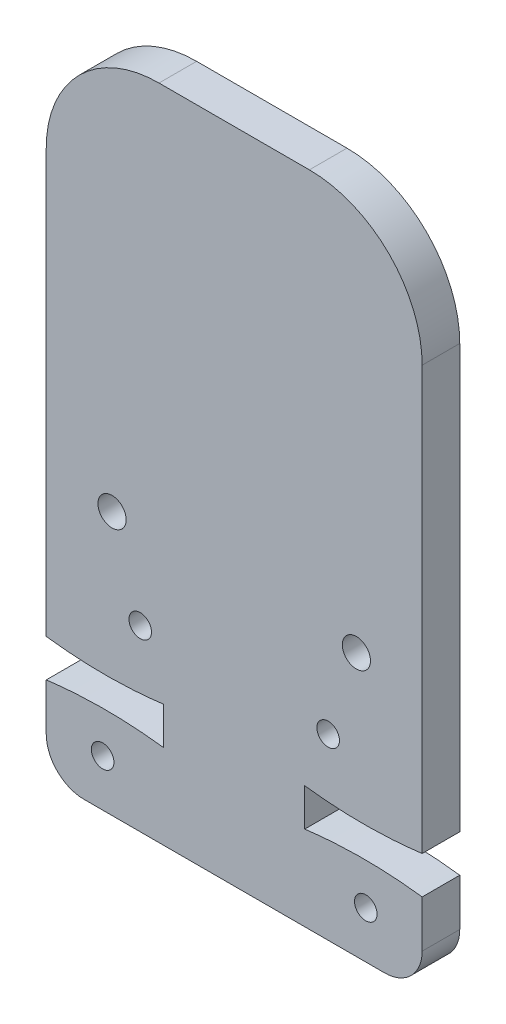
ISO-10303-21;
HEADER;
FILE_DESCRIPTION(('STEP AP214'),'2;1');
FILE_NAME('part.step','',(''),(''),'','','');
FILE_SCHEMA(('AUTOMOTIVE_DESIGN { 1 0 10303 214 1 1 1 1 }'));
ENDSEC;
DATA;
#1=APPLICATION_CONTEXT('core data for automotive mechanical design processes');
#2=APPLICATION_PROTOCOL_DEFINITION('international standard','automotive_design',2000,#1);
#3=PRODUCT_CONTEXT('',#1,'mechanical');
#4=PRODUCT('Part','Part','',(#3));
#5=PRODUCT_RELATED_PRODUCT_CATEGORY('part','',(#4));
#6=PRODUCT_DEFINITION_FORMATION('','',#4);
#7=PRODUCT_DEFINITION_CONTEXT('part definition',#1,'design');
#8=PRODUCT_DEFINITION('design','',#6,#7);
#9=PRODUCT_DEFINITION_SHAPE('','',#8);
#10=(LENGTH_UNIT() NAMED_UNIT(*) SI_UNIT(.MILLI.,.METRE.));
#11=(NAMED_UNIT(*) PLANE_ANGLE_UNIT() SI_UNIT($,.RADIAN.));
#12=(NAMED_UNIT(*) SI_UNIT($,.STERADIAN.) SOLID_ANGLE_UNIT());
#13=UNCERTAINTY_MEASURE_WITH_UNIT(LENGTH_MEASURE(1.E-05),#10,'distance_accuracy_value','');
#14=(GEOMETRIC_REPRESENTATION_CONTEXT(3) GLOBAL_UNCERTAINTY_ASSIGNED_CONTEXT((#13)) GLOBAL_UNIT_ASSIGNED_CONTEXT((#10,
#11,#12)) REPRESENTATION_CONTEXT('',''));
#15=CARTESIAN_POINT('',(0.,0.,0.));
#16=DIRECTION('',(0.,0.,1.));
#17=DIRECTION('',(1.,0.,0.));
#18=AXIS2_PLACEMENT_3D('',#15,#16,#17);
#19=CARTESIAN_POINT('',(3.125,6.3,2.));
#20=DIRECTION('',(0.,0.,-1.));
#21=DIRECTION('',(-1.,0.,0.));
#22=AXIS2_PLACEMENT_3D('',#19,#20,#21);
#23=PLANE('',#22);
#24=CARTESIAN_POINT('',(17.,2.5,2.));
#25=DIRECTION('',(0.,0.,1.));
#26=DIRECTION('',(-1.,0.,0.));
#27=AXIS2_PLACEMENT_3D('',#24,#25,#26);
#28=CIRCLE('',#27,0.6);
#29=CARTESIAN_POINT('',(16.4,2.5,2.));
#30=VERTEX_POINT('',#29);
#31=EDGE_CURVE('E390',#30,#30,#28,.T.);
#32=ORIENTED_EDGE('',*,*,#31,.F.);
#33=EDGE_LOOP('',(#32));
#34=FACE_BOUND('',#33,.T.);
#35=CARTESIAN_POINT('',(5.,9.5,2.));
#36=DIRECTION('',(0.,0.,1.));
#37=DIRECTION('',(1.,0.,0.));
#38=AXIS2_PLACEMENT_3D('',#35,#36,#37);
#39=CIRCLE('',#38,0.6);
#40=CARTESIAN_POINT('',(5.6,9.5,2.));
#41=VERTEX_POINT('',#40);
#42=EDGE_CURVE('E378',#41,#41,#39,.T.);
#43=ORIENTED_EDGE('',*,*,#42,.F.);
#44=EDGE_LOOP('',(#43));
#45=FACE_BOUND('',#44,.T.);
#46=CARTESIAN_POINT('',(3.,2.5,2.));
#47=DIRECTION('',(0.,0.,1.));
#48=DIRECTION('',(1.,0.,0.));
#49=AXIS2_PLACEMENT_3D('',#46,#47,#48);
#50=CIRCLE('',#49,0.6);
#51=CARTESIAN_POINT('',(3.6,2.5,2.));
#52=VERTEX_POINT('',#51);
#53=EDGE_CURVE('E303',#52,#52,#50,.T.);
#54=ORIENTED_EDGE('',*,*,#53,.F.);
#55=EDGE_LOOP('',(#54));
#56=FACE_BOUND('',#55,.T.);
#57=DIRECTION('',(-1.,0.,0.));
#58=VECTOR('',#57,1.);
#59=CARTESIAN_POINT('',(20.,35.,2.));
#60=LINE('',#59,#58);
#61=CARTESIAN_POINT('',(14.,35.,2.));
#62=VERTEX_POINT('',#61);
#63=CARTESIAN_POINT('',(6.,35.,2.));
#64=VERTEX_POINT('',#63);
#65=EDGE_CURVE('E263',#62,#64,#60,.T.);
#66=ORIENTED_EDGE('',*,*,#65,.T.);
#67=CARTESIAN_POINT('',(6.,29.,2.));
#68=DIRECTION('',(0.,0.,-1.));
#69=DIRECTION('',(-1.,0.,0.));
#70=AXIS2_PLACEMENT_3D('',#67,#68,#69);
#71=CIRCLE('',#70,6.);
#72=CARTESIAN_POINT('',(0.,29.,2.));
#73=VERTEX_POINT('',#72);
#74=EDGE_CURVE('E154',#64,#73,#71,.F.);
#75=ORIENTED_EDGE('',*,*,#74,.T.);
#76=DIRECTION('',(0.,-1.,0.));
#77=VECTOR('',#76,1.);
#78=CARTESIAN_POINT('',(0.,35.,2.));
#79=LINE('',#78,#77);
#80=CARTESIAN_POINT('',(0.,6.5,2.));
#81=VERTEX_POINT('',#80);
#82=EDGE_CURVE('E147',#73,#81,#79,.T.);
#83=ORIENTED_EDGE('',*,*,#82,.T.);
#84=CARTESIAN_POINT('',(0.,6.5,2.));
#85=CARTESIAN_POINT('',(3.125,6.1,2.));
#86=CARTESIAN_POINT('',(6.25,6.5,2.));
#87=B_SPLINE_CURVE_WITH_KNOTS('',2,(#84,#85,#86),.UNSPECIFIED.,.F.,.F.,(3,3),(0.,1.),.UNSPECIFIED.);
#88=CARTESIAN_POINT('',(6.25,6.5,2.));
#89=VERTEX_POINT('',#88);
#90=EDGE_CURVE('E151',#81,#89,#87,.T.);
#91=ORIENTED_EDGE('',*,*,#90,.T.);
#92=DIRECTION('',(0.,-1.,0.));
#93=VECTOR('',#92,1.);
#94=CARTESIAN_POINT('',(6.25,4.5,2.));
#95=LINE('',#94,#93);
#96=CARTESIAN_POINT('',(6.25,4.5,2.));
#97=VERTEX_POINT('',#96);
#98=EDGE_CURVE('E168',#89,#97,#95,.T.);
#99=ORIENTED_EDGE('',*,*,#98,.T.);
#100=CARTESIAN_POINT('',(6.25,4.5,2.));
#101=CARTESIAN_POINT('',(3.125,4.9,2.));
#102=CARTESIAN_POINT('',(0.,4.5,2.));
#103=B_SPLINE_CURVE_WITH_KNOTS('',2,(#100,#101,#102),.UNSPECIFIED.,.F.,.F.,(3,3),(0.,1.),.UNSPECIFIED.);
#104=CARTESIAN_POINT('',(0.,4.5,2.));
#105=VERTEX_POINT('',#104);
#106=EDGE_CURVE('E281',#97,#105,#103,.T.);
#107=ORIENTED_EDGE('',*,*,#106,.T.);
#108=DIRECTION('',(0.,-1.,0.));
#109=VECTOR('',#108,1.);
#110=CARTESIAN_POINT('',(0.,4.5,2.));
#111=LINE('',#110,#109);
#112=CARTESIAN_POINT('',(0.,2.,2.));
#113=VERTEX_POINT('',#112);
#114=EDGE_CURVE('E219',#105,#113,#111,.T.);
#115=ORIENTED_EDGE('',*,*,#114,.T.);
#116=CARTESIAN_POINT('',(2.,2.,2.));
#117=DIRECTION('',(0.,0.,-1.));
#118=DIRECTION('',(-1.,0.,0.));
#119=AXIS2_PLACEMENT_3D('',#116,#117,#118);
#120=CIRCLE('',#119,2.);
#121=CARTESIAN_POINT('',(2.,0.,2.));
#122=VERTEX_POINT('',#121);
#123=EDGE_CURVE('E194',#113,#122,#120,.F.);
#124=ORIENTED_EDGE('',*,*,#123,.T.);
#125=DIRECTION('',(1.,0.,0.));
#126=VECTOR('',#125,1.);
#127=CARTESIAN_POINT('',(0.,0.,2.));
#128=LINE('',#127,#126);
#129=CARTESIAN_POINT('',(18.,0.,2.));
#130=VERTEX_POINT('',#129);
#131=EDGE_CURVE('E211',#122,#130,#128,.T.);
#132=ORIENTED_EDGE('',*,*,#131,.T.);
#133=CARTESIAN_POINT('',(18.,2.,2.));
#134=DIRECTION('',(0.,0.,-1.));
#135=DIRECTION('',(-1.,0.,0.));
#136=AXIS2_PLACEMENT_3D('',#133,#134,#135);
#137=CIRCLE('',#136,2.);
#138=CARTESIAN_POINT('',(20.,2.,2.));
#139=VERTEX_POINT('',#138);
#140=EDGE_CURVE('E57',#130,#139,#137,.F.);
#141=ORIENTED_EDGE('',*,*,#140,.T.);
#142=DIRECTION('',(0.,1.,0.));
#143=VECTOR('',#142,1.);
#144=CARTESIAN_POINT('',(20.,4.5,2.));
#145=LINE('',#144,#143);
#146=CARTESIAN_POINT('',(20.,4.5,2.));
#147=VERTEX_POINT('',#146);
#148=EDGE_CURVE('E218',#139,#147,#145,.T.);
#149=ORIENTED_EDGE('',*,*,#148,.T.);
#150=CARTESIAN_POINT('',(20.,4.5,2.));
#151=CARTESIAN_POINT('',(16.875,4.9,2.));
#152=CARTESIAN_POINT('',(13.75,4.5,2.));
#153=B_SPLINE_CURVE_WITH_KNOTS('',2,(#150,#151,#152),.UNSPECIFIED.,.F.,.F.,(3,3),(0.,1.),.UNSPECIFIED.);
#154=CARTESIAN_POINT('',(13.75,4.5,2.));
#155=VERTEX_POINT('',#154);
#156=EDGE_CURVE('E334',#147,#155,#153,.T.);
#157=ORIENTED_EDGE('',*,*,#156,.T.);
#158=DIRECTION('',(0.,1.,0.));
#159=VECTOR('',#158,1.);
#160=CARTESIAN_POINT('',(13.75,4.5,2.));
#161=LINE('',#160,#159);
#162=CARTESIAN_POINT('',(13.75,6.5,2.));
#163=VERTEX_POINT('',#162);
#164=EDGE_CURVE('E312',#155,#163,#161,.T.);
#165=ORIENTED_EDGE('',*,*,#164,.T.);
#166=CARTESIAN_POINT('',(13.75,6.5,2.));
#167=CARTESIAN_POINT('',(16.875,6.1,2.));
#168=CARTESIAN_POINT('',(20.,6.5,2.));
#169=B_SPLINE_CURVE_WITH_KNOTS('',2,(#166,#167,#168),.UNSPECIFIED.,.F.,.F.,(3,3),(0.,1.),.UNSPECIFIED.);
#170=CARTESIAN_POINT('',(20.,6.5,2.));
#171=VERTEX_POINT('',#170);
#172=EDGE_CURVE('E307',#163,#171,#169,.T.);
#173=ORIENTED_EDGE('',*,*,#172,.T.);
#174=DIRECTION('',(0.,1.,0.));
#175=VECTOR('',#174,1.);
#176=CARTESIAN_POINT('',(20.,35.,2.));
#177=LINE('',#176,#175);
#178=CARTESIAN_POINT('',(20.,29.,2.));
#179=VERTEX_POINT('',#178);
#180=EDGE_CURVE('E305',#171,#179,#177,.T.);
#181=ORIENTED_EDGE('',*,*,#180,.T.);
#182=CARTESIAN_POINT('',(14.,29.,2.));
#183=DIRECTION('',(0.,0.,-1.));
#184=DIRECTION('',(-1.,0.,0.));
#185=AXIS2_PLACEMENT_3D('',#182,#183,#184);
#186=CIRCLE('',#185,6.);
#187=EDGE_CURVE('E197',#179,#62,#186,.F.);
#188=ORIENTED_EDGE('',*,*,#187,.T.);
#189=EDGE_LOOP('',(#66,#75,#83,#91,#99,#107,#115,#124,#132,#141,#149,#157,#165,#173,#181,#188));
#190=FACE_BOUND('',#189,.T.);
#191=CARTESIAN_POINT('',(3.5,14.,2.));
#192=DIRECTION('',(0.,0.,1.));
#193=DIRECTION('',(1.,0.,0.));
#194=AXIS2_PLACEMENT_3D('',#191,#192,#193);
#195=CIRCLE('',#194,0.749999999999986);
#196=CARTESIAN_POINT('',(4.24999999999998,14.,2.));
#197=VERTEX_POINT('',#196);
#198=EDGE_CURVE('E372',#197,#197,#195,.T.);
#199=ORIENTED_EDGE('',*,*,#198,.F.);
#200=EDGE_LOOP('',(#199));
#201=FACE_BOUND('',#200,.T.);
#202=CARTESIAN_POINT('',(16.5,14.,2.));
#203=DIRECTION('',(0.,0.,1.));
#204=DIRECTION('',(-1.,0.,0.));
#205=AXIS2_PLACEMENT_3D('',#202,#203,#204);
#206=CIRCLE('',#205,0.749999999999998);
#207=CARTESIAN_POINT('',(15.75,14.,2.));
#208=VERTEX_POINT('',#207);
#209=EDGE_CURVE('E384',#208,#208,#206,.T.);
#210=ORIENTED_EDGE('',*,*,#209,.F.);
#211=EDGE_LOOP('',(#210));
#212=FACE_BOUND('',#211,.T.);
#213=CARTESIAN_POINT('',(15.,9.5,2.));
#214=DIRECTION('',(0.,0.,1.));
#215=DIRECTION('',(-1.,0.,0.));
#216=AXIS2_PLACEMENT_3D('',#213,#214,#215);
#217=CIRCLE('',#216,0.6);
#218=CARTESIAN_POINT('',(14.4,9.5,2.));
#219=VERTEX_POINT('',#218);
#220=EDGE_CURVE('E396',#219,#219,#217,.T.);
#221=ORIENTED_EDGE('',*,*,#220,.F.);
#222=EDGE_LOOP('',(#221));
#223=FACE_BOUND('',#222,.T.);
#224=ADVANCED_FACE('F34',(#34,#45,#56,#190,#201,#212,#223),#23,.F.);
#225=CARTESIAN_POINT('',(3.125,6.3,0.));
#226=DIRECTION('',(0.,0.,-1.));
#227=DIRECTION('',(-1.,0.,0.));
#228=AXIS2_PLACEMENT_3D('',#225,#226,#227);
#229=PLANE('',#228);
#230=CARTESIAN_POINT('',(17.,2.5,0.));
#231=DIRECTION('',(0.,0.,1.));
#232=DIRECTION('',(-1.,0.,0.));
#233=AXIS2_PLACEMENT_3D('',#230,#231,#232);
#234=CIRCLE('',#233,0.6);
#235=CARTESIAN_POINT('',(16.4,2.5,0.));
#236=VERTEX_POINT('',#235);
#237=EDGE_CURVE('E393',#236,#236,#234,.T.);
#238=ORIENTED_EDGE('',*,*,#237,.T.);
#239=EDGE_LOOP('',(#238));
#240=FACE_BOUND('',#239,.T.);
#241=CARTESIAN_POINT('',(5.,9.5,0.));
#242=DIRECTION('',(0.,0.,1.));
#243=DIRECTION('',(1.,0.,0.));
#244=AXIS2_PLACEMENT_3D('',#241,#242,#243);
#245=CIRCLE('',#244,0.6);
#246=CARTESIAN_POINT('',(5.6,9.5,0.));
#247=VERTEX_POINT('',#246);
#248=EDGE_CURVE('E381',#247,#247,#245,.T.);
#249=ORIENTED_EDGE('',*,*,#248,.T.);
#250=EDGE_LOOP('',(#249));
#251=FACE_BOUND('',#250,.T.);
#252=CARTESIAN_POINT('',(3.,2.5,0.));
#253=DIRECTION('',(0.,0.,1.));
#254=DIRECTION('',(1.,0.,0.));
#255=AXIS2_PLACEMENT_3D('',#252,#253,#254);
#256=CIRCLE('',#255,0.6);
#257=CARTESIAN_POINT('',(3.6,2.5,0.));
#258=VERTEX_POINT('',#257);
#259=EDGE_CURVE('E369',#258,#258,#256,.T.);
#260=ORIENTED_EDGE('',*,*,#259,.T.);
#261=EDGE_LOOP('',(#260));
#262=FACE_BOUND('',#261,.T.);
#263=DIRECTION('',(0.,-1.,0.));
#264=VECTOR('',#263,1.);
#265=CARTESIAN_POINT('',(0.,35.,0.));
#266=LINE('',#265,#264);
#267=CARTESIAN_POINT('',(0.,29.,0.));
#268=VERTEX_POINT('',#267);
#269=CARTESIAN_POINT('',(0.,6.5,0.));
#270=VERTEX_POINT('',#269);
#271=EDGE_CURVE('E172',#268,#270,#266,.T.);
#272=ORIENTED_EDGE('',*,*,#271,.F.);
#273=CARTESIAN_POINT('',(6.,29.,0.));
#274=DIRECTION('',(0.,0.,-1.));
#275=DIRECTION('',(-1.,0.,0.));
#276=AXIS2_PLACEMENT_3D('',#273,#274,#275);
#277=CIRCLE('',#276,6.);
#278=CARTESIAN_POINT('',(6.,35.,0.));
#279=VERTEX_POINT('',#278);
#280=EDGE_CURVE('E187',#268,#279,#277,.T.);
#281=ORIENTED_EDGE('',*,*,#280,.T.);
#282=DIRECTION('',(-1.,0.,0.));
#283=VECTOR('',#282,1.);
#284=CARTESIAN_POINT('',(20.,35.,0.));
#285=LINE('',#284,#283);
#286=CARTESIAN_POINT('',(14.,35.,0.));
#287=VERTEX_POINT('',#286);
#288=EDGE_CURVE('E159',#287,#279,#285,.T.);
#289=ORIENTED_EDGE('',*,*,#288,.F.);
#290=CARTESIAN_POINT('',(14.,29.,0.));
#291=DIRECTION('',(0.,0.,-1.));
#292=DIRECTION('',(-1.,0.,0.));
#293=AXIS2_PLACEMENT_3D('',#290,#291,#292);
#294=CIRCLE('',#293,6.);
#295=CARTESIAN_POINT('',(20.,29.,0.));
#296=VERTEX_POINT('',#295);
#297=EDGE_CURVE('E185',#287,#296,#294,.T.);
#298=ORIENTED_EDGE('',*,*,#297,.T.);
#299=DIRECTION('',(0.,1.,0.));
#300=VECTOR('',#299,1.);
#301=CARTESIAN_POINT('',(20.,35.,0.));
#302=LINE('',#301,#300);
#303=CARTESIAN_POINT('',(20.,6.5,0.));
#304=VERTEX_POINT('',#303);
#305=EDGE_CURVE('E252',#304,#296,#302,.T.);
#306=ORIENTED_EDGE('',*,*,#305,.F.);
#307=CARTESIAN_POINT('',(13.75,6.5,0.));
#308=CARTESIAN_POINT('',(16.875,6.1,0.));
#309=CARTESIAN_POINT('',(20.,6.5,0.));
#310=B_SPLINE_CURVE_WITH_KNOTS('',2,(#307,#308,#309),.UNSPECIFIED.,.F.,.F.,(3,3),(0.,1.),.UNSPECIFIED.);
#311=CARTESIAN_POINT('',(13.75,6.5,0.));
#312=VERTEX_POINT('',#311);
#313=EDGE_CURVE('E248',#312,#304,#310,.T.);
#314=ORIENTED_EDGE('',*,*,#313,.F.);
#315=DIRECTION('',(0.,1.,0.));
#316=VECTOR('',#315,1.);
#317=CARTESIAN_POINT('',(13.75,4.5,0.));
#318=LINE('',#317,#316);
#319=CARTESIAN_POINT('',(13.75,4.5,0.));
#320=VERTEX_POINT('',#319);
#321=EDGE_CURVE('E236',#320,#312,#318,.T.);
#322=ORIENTED_EDGE('',*,*,#321,.F.);
#323=CARTESIAN_POINT('',(20.,4.5,0.));
#324=CARTESIAN_POINT('',(16.875,4.9,0.));
#325=CARTESIAN_POINT('',(13.75,4.5,0.));
#326=B_SPLINE_CURVE_WITH_KNOTS('',2,(#323,#324,#325),.UNSPECIFIED.,.F.,.F.,(3,3),(0.,1.),.UNSPECIFIED.);
#327=CARTESIAN_POINT('',(20.,4.5,0.));
#328=VERTEX_POINT('',#327);
#329=EDGE_CURVE('E234',#328,#320,#326,.T.);
#330=ORIENTED_EDGE('',*,*,#329,.F.);
#331=DIRECTION('',(0.,1.,0.));
#332=VECTOR('',#331,1.);
#333=CARTESIAN_POINT('',(20.,4.5,0.));
#334=LINE('',#333,#332);
#335=CARTESIAN_POINT('',(20.,2.,0.));
#336=VERTEX_POINT('',#335);
#337=EDGE_CURVE('E227',#336,#328,#334,.T.);
#338=ORIENTED_EDGE('',*,*,#337,.F.);
#339=CARTESIAN_POINT('',(18.,2.,0.));
#340=DIRECTION('',(0.,0.,-1.));
#341=DIRECTION('',(-1.,0.,0.));
#342=AXIS2_PLACEMENT_3D('',#339,#340,#341);
#343=CIRCLE('',#342,2.);
#344=CARTESIAN_POINT('',(18.,0.,0.));
#345=VERTEX_POINT('',#344);
#346=EDGE_CURVE('E183',#336,#345,#343,.T.);
#347=ORIENTED_EDGE('',*,*,#346,.T.);
#348=DIRECTION('',(1.,0.,0.));
#349=VECTOR('',#348,1.);
#350=CARTESIAN_POINT('',(0.,0.,0.));
#351=LINE('',#350,#349);
#352=CARTESIAN_POINT('',(2.,0.,0.));
#353=VERTEX_POINT('',#352);
#354=EDGE_CURVE('E214',#353,#345,#351,.T.);
#355=ORIENTED_EDGE('',*,*,#354,.F.);
#356=CARTESIAN_POINT('',(2.,2.,0.));
#357=DIRECTION('',(0.,0.,-1.));
#358=DIRECTION('',(-1.,0.,0.));
#359=AXIS2_PLACEMENT_3D('',#356,#357,#358);
#360=CIRCLE('',#359,2.);
#361=CARTESIAN_POINT('',(0.,2.,0.));
#362=VERTEX_POINT('',#361);
#363=EDGE_CURVE('E176',#353,#362,#360,.T.);
#364=ORIENTED_EDGE('',*,*,#363,.T.);
#365=DIRECTION('',(0.,-1.,0.));
#366=VECTOR('',#365,1.);
#367=CARTESIAN_POINT('',(0.,4.5,0.));
#368=LINE('',#367,#366);
#369=CARTESIAN_POINT('',(0.,4.5,0.));
#370=VERTEX_POINT('',#369);
#371=EDGE_CURVE('E238',#370,#362,#368,.T.);
#372=ORIENTED_EDGE('',*,*,#371,.F.);
#373=CARTESIAN_POINT('',(6.25,4.5,0.));
#374=CARTESIAN_POINT('',(3.125,4.9,0.));
#375=CARTESIAN_POINT('',(0.,4.5,0.));
#376=B_SPLINE_CURVE_WITH_KNOTS('',2,(#373,#374,#375),.UNSPECIFIED.,.F.,.F.,(3,3),(0.,1.),.UNSPECIFIED.);
#377=CARTESIAN_POINT('',(6.25,4.5,0.));
#378=VERTEX_POINT('',#377);
#379=EDGE_CURVE('E280',#378,#370,#376,.T.);
#380=ORIENTED_EDGE('',*,*,#379,.F.);
#381=DIRECTION('',(0.,-1.,0.));
#382=VECTOR('',#381,1.);
#383=CARTESIAN_POINT('',(6.25,4.5,0.));
#384=LINE('',#383,#382);
#385=CARTESIAN_POINT('',(6.25,6.5,0.));
#386=VERTEX_POINT('',#385);
#387=EDGE_CURVE('E285',#386,#378,#384,.T.);
#388=ORIENTED_EDGE('',*,*,#387,.F.);
#389=CARTESIAN_POINT('',(0.,6.5,0.));
#390=CARTESIAN_POINT('',(3.125,6.1,0.));
#391=CARTESIAN_POINT('',(6.25,6.5,0.));
#392=B_SPLINE_CURVE_WITH_KNOTS('',2,(#389,#390,#391),.UNSPECIFIED.,.F.,.F.,(3,3),(0.,1.),.UNSPECIFIED.);
#393=EDGE_CURVE('E288',#270,#386,#392,.T.);
#394=ORIENTED_EDGE('',*,*,#393,.F.);
#395=EDGE_LOOP('',(#272,#281,#289,#298,#306,#314,#322,#330,#338,#347,#355,#364,#372,#380,#388,#394));
#396=FACE_BOUND('',#395,.T.);
#397=CARTESIAN_POINT('',(3.5,14.,0.));
#398=DIRECTION('',(0.,0.,1.));
#399=DIRECTION('',(1.,0.,0.));
#400=AXIS2_PLACEMENT_3D('',#397,#398,#399);
#401=CIRCLE('',#400,0.749999999999986);
#402=CARTESIAN_POINT('',(4.24999999999998,14.,0.));
#403=VERTEX_POINT('',#402);
#404=EDGE_CURVE('E375',#403,#403,#401,.T.);
#405=ORIENTED_EDGE('',*,*,#404,.T.);
#406=EDGE_LOOP('',(#405));
#407=FACE_BOUND('',#406,.T.);
#408=CARTESIAN_POINT('',(16.5,14.,0.));
#409=DIRECTION('',(0.,0.,1.));
#410=DIRECTION('',(-1.,0.,0.));
#411=AXIS2_PLACEMENT_3D('',#408,#409,#410);
#412=CIRCLE('',#411,0.749999999999998);
#413=CARTESIAN_POINT('',(15.75,14.,0.));
#414=VERTEX_POINT('',#413);
#415=EDGE_CURVE('E387',#414,#414,#412,.T.);
#416=ORIENTED_EDGE('',*,*,#415,.T.);
#417=EDGE_LOOP('',(#416));
#418=FACE_BOUND('',#417,.T.);
#419=CARTESIAN_POINT('',(15.,9.5,0.));
#420=DIRECTION('',(0.,0.,1.));
#421=DIRECTION('',(-1.,0.,0.));
#422=AXIS2_PLACEMENT_3D('',#419,#420,#421);
#423=CIRCLE('',#422,0.6);
#424=CARTESIAN_POINT('',(14.4,9.5,0.));
#425=VERTEX_POINT('',#424);
#426=EDGE_CURVE('E399',#425,#425,#423,.T.);
#427=ORIENTED_EDGE('',*,*,#426,.T.);
#428=EDGE_LOOP('',(#427));
#429=FACE_BOUND('',#428,.T.);
#430=ADVANCED_FACE('F231',(#240,#251,#262,#396,#407,#418,#429),#229,.T.);
#431=CARTESIAN_POINT('',(0.,35.,2.));
#432=DIRECTION('',(1.,0.,0.));
#433=DIRECTION('',(0.,1.,0.));
#434=AXIS2_PLACEMENT_3D('',#431,#432,#433);
#435=PLANE('',#434);
#436=ORIENTED_EDGE('',*,*,#82,.F.);
#437=DIRECTION('',(0.,0.,-1.));
#438=VECTOR('',#437,1.);
#439=CARTESIAN_POINT('',(0.,29.,2.));
#440=LINE('',#439,#438);
#441=EDGE_CURVE('E174',#73,#268,#440,.T.);
#442=ORIENTED_EDGE('',*,*,#441,.T.);
#443=ORIENTED_EDGE('',*,*,#271,.T.);
#444=DIRECTION('',(0.,0.,-1.));
#445=VECTOR('',#444,1.);
#446=CARTESIAN_POINT('',(0.,6.5,2.));
#447=LINE('',#446,#445);
#448=EDGE_CURVE('E164',#81,#270,#447,.T.);
#449=ORIENTED_EDGE('',*,*,#448,.F.);
#450=EDGE_LOOP('',(#436,#442,#443,#449));
#451=FACE_BOUND('',#450,.T.);
#452=ADVANCED_FACE('F170',(#451),#435,.F.);
#453=DIRECTION('',(0.,0.,-1.));
#454=VECTOR('',#453,1.);
#455=SURFACE_OF_LINEAR_EXTRUSION('',#87,#454);
#456=ORIENTED_EDGE('',*,*,#393,.T.);
#457=DIRECTION('',(0.,0.,-1.));
#458=VECTOR('',#457,1.);
#459=CARTESIAN_POINT('',(6.25,6.5,2.));
#460=LINE('',#459,#458);
#461=EDGE_CURVE('E166',#89,#386,#460,.T.);
#462=ORIENTED_EDGE('',*,*,#461,.F.);
#463=ORIENTED_EDGE('',*,*,#90,.F.);
#464=ORIENTED_EDGE('',*,*,#448,.T.);
#465=EDGE_LOOP('',(#456,#462,#463,#464));
#466=FACE_BOUND('',#465,.T.);
#467=ADVANCED_FACE('F163',(#466),#455,.F.);
#468=CARTESIAN_POINT('',(6.25,4.5,2.));
#469=DIRECTION('',(1.,0.,0.));
#470=DIRECTION('',(0.,0.,-1.));
#471=AXIS2_PLACEMENT_3D('',#468,#469,#470);
#472=PLANE('',#471);
#473=ORIENTED_EDGE('',*,*,#387,.T.);
#474=DIRECTION('',(0.,0.,-1.));
#475=VECTOR('',#474,1.);
#476=CARTESIAN_POINT('',(6.25,4.5,2.));
#477=LINE('',#476,#475);
#478=EDGE_CURVE('E178',#97,#378,#477,.T.);
#479=ORIENTED_EDGE('',*,*,#478,.F.);
#480=ORIENTED_EDGE('',*,*,#98,.F.);
#481=ORIENTED_EDGE('',*,*,#461,.T.);
#482=EDGE_LOOP('',(#473,#479,#480,#481));
#483=FACE_BOUND('',#482,.T.);
#484=ADVANCED_FACE('F356',(#483),#472,.F.);
#485=DIRECTION('',(0.,0.,-1.));
#486=VECTOR('',#485,1.);
#487=SURFACE_OF_LINEAR_EXTRUSION('',#103,#486);
#488=ORIENTED_EDGE('',*,*,#379,.T.);
#489=DIRECTION('',(0.,0.,-1.));
#490=VECTOR('',#489,1.);
#491=CARTESIAN_POINT('',(0.,4.5,2.));
#492=LINE('',#491,#490);
#493=EDGE_CURVE('E271',#105,#370,#492,.T.);
#494=ORIENTED_EDGE('',*,*,#493,.F.);
#495=ORIENTED_EDGE('',*,*,#106,.F.);
#496=ORIENTED_EDGE('',*,*,#478,.T.);
#497=EDGE_LOOP('',(#488,#494,#495,#496));
#498=FACE_BOUND('',#497,.T.);
#499=ADVANCED_FACE('F278',(#498),#487,.F.);
#500=CARTESIAN_POINT('',(0.,4.5,2.));
#501=DIRECTION('',(1.,0.,0.));
#502=DIRECTION('',(0.,1.,0.));
#503=AXIS2_PLACEMENT_3D('',#500,#501,#502);
#504=PLANE('',#503);
#505=ORIENTED_EDGE('',*,*,#371,.T.);
#506=DIRECTION('',(0.,0.,-1.));
#507=VECTOR('',#506,1.);
#508=CARTESIAN_POINT('',(0.,2.,2.));
#509=LINE('',#508,#507);
#510=EDGE_CURVE('E12',#362,#113,#509,.F.);
#511=ORIENTED_EDGE('',*,*,#510,.T.);
#512=ORIENTED_EDGE('',*,*,#114,.F.);
#513=ORIENTED_EDGE('',*,*,#493,.T.);
#514=EDGE_LOOP('',(#505,#511,#512,#513));
#515=FACE_BOUND('',#514,.T.);
#516=ADVANCED_FACE('F355',(#515),#504,.F.);
#517=CARTESIAN_POINT('',(0.,0.,2.));
#518=DIRECTION('',(0.,1.,0.));
#519=DIRECTION('',(-1.,0.,0.));
#520=AXIS2_PLACEMENT_3D('',#517,#518,#519);
#521=PLANE('',#520);
#522=ORIENTED_EDGE('',*,*,#354,.T.);
#523=DIRECTION('',(0.,0.,-1.));
#524=VECTOR('',#523,1.);
#525=CARTESIAN_POINT('',(18.,0.,2.));
#526=LINE('',#525,#524);
#527=EDGE_CURVE('E42',#345,#130,#526,.F.);
#528=ORIENTED_EDGE('',*,*,#527,.T.);
#529=ORIENTED_EDGE('',*,*,#131,.F.);
#530=DIRECTION('',(0.,0.,-1.));
#531=VECTOR('',#530,1.);
#532=CARTESIAN_POINT('',(2.,0.,2.));
#533=LINE('',#532,#531);
#534=EDGE_CURVE('E204',#122,#353,#533,.T.);
#535=ORIENTED_EDGE('',*,*,#534,.T.);
#536=EDGE_LOOP('',(#522,#528,#529,#535));
#537=FACE_BOUND('',#536,.T.);
#538=ADVANCED_FACE('F210',(#537),#521,.F.);
#539=CARTESIAN_POINT('',(20.,4.5,2.));
#540=DIRECTION('',(-1.,0.,0.));
#541=DIRECTION('',(0.,-1.,0.));
#542=AXIS2_PLACEMENT_3D('',#539,#540,#541);
#543=PLANE('',#542);
#544=ORIENTED_EDGE('',*,*,#148,.F.);
#545=DIRECTION('',(0.,0.,-1.));
#546=VECTOR('',#545,1.);
#547=CARTESIAN_POINT('',(20.,2.,2.));
#548=LINE('',#547,#546);
#549=EDGE_CURVE('E201',#139,#336,#548,.T.);
#550=ORIENTED_EDGE('',*,*,#549,.T.);
#551=ORIENTED_EDGE('',*,*,#337,.T.);
#552=DIRECTION('',(0.,0.,-1.));
#553=VECTOR('',#552,1.);
#554=CARTESIAN_POINT('',(20.,4.5,2.));
#555=LINE('',#554,#553);
#556=EDGE_CURVE('E269',#147,#328,#555,.T.);
#557=ORIENTED_EDGE('',*,*,#556,.F.);
#558=EDGE_LOOP('',(#544,#550,#551,#557));
#559=FACE_BOUND('',#558,.T.);
#560=ADVANCED_FACE('F225',(#559),#543,.F.);
#561=DIRECTION('',(0.,0.,-1.));
#562=VECTOR('',#561,1.);
#563=SURFACE_OF_LINEAR_EXTRUSION('',#153,#562);
#564=ORIENTED_EDGE('',*,*,#329,.T.);
#565=DIRECTION('',(0.,0.,-1.));
#566=VECTOR('',#565,1.);
#567=CARTESIAN_POINT('',(13.75,4.5,2.));
#568=LINE('',#567,#566);
#569=EDGE_CURVE('E266',#155,#320,#568,.T.);
#570=ORIENTED_EDGE('',*,*,#569,.F.);
#571=ORIENTED_EDGE('',*,*,#156,.F.);
#572=ORIENTED_EDGE('',*,*,#556,.T.);
#573=EDGE_LOOP('',(#564,#570,#571,#572));
#574=FACE_BOUND('',#573,.T.);
#575=ADVANCED_FACE('F328',(#574),#563,.F.);
#576=CARTESIAN_POINT('',(13.75,4.5,2.));
#577=DIRECTION('',(-1.,0.,0.));
#578=DIRECTION('',(0.,0.,1.));
#579=AXIS2_PLACEMENT_3D('',#576,#577,#578);
#580=PLANE('',#579);
#581=ORIENTED_EDGE('',*,*,#321,.T.);
#582=DIRECTION('',(0.,0.,-1.));
#583=VECTOR('',#582,1.);
#584=CARTESIAN_POINT('',(13.75,6.5,2.));
#585=LINE('',#584,#583);
#586=EDGE_CURVE('E262',#163,#312,#585,.T.);
#587=ORIENTED_EDGE('',*,*,#586,.F.);
#588=ORIENTED_EDGE('',*,*,#164,.F.);
#589=ORIENTED_EDGE('',*,*,#569,.T.);
#590=EDGE_LOOP('',(#581,#587,#588,#589));
#591=FACE_BOUND('',#590,.T.);
#592=ADVANCED_FACE('F323',(#591),#580,.F.);
#593=DIRECTION('',(0.,0.,-1.));
#594=VECTOR('',#593,1.);
#595=SURFACE_OF_LINEAR_EXTRUSION('',#169,#594);
#596=ORIENTED_EDGE('',*,*,#313,.T.);
#597=DIRECTION('',(0.,0.,-1.));
#598=VECTOR('',#597,1.);
#599=CARTESIAN_POINT('',(20.,6.5,2.));
#600=LINE('',#599,#598);
#601=EDGE_CURVE('E259',#171,#304,#600,.T.);
#602=ORIENTED_EDGE('',*,*,#601,.F.);
#603=ORIENTED_EDGE('',*,*,#172,.F.);
#604=ORIENTED_EDGE('',*,*,#586,.T.);
#605=EDGE_LOOP('',(#596,#602,#603,#604));
#606=FACE_BOUND('',#605,.T.);
#607=ADVANCED_FACE('F318',(#606),#595,.F.);
#608=CARTESIAN_POINT('',(20.,35.,2.));
#609=DIRECTION('',(-1.,0.,0.));
#610=DIRECTION('',(0.,-1.,0.));
#611=AXIS2_PLACEMENT_3D('',#608,#609,#610);
#612=PLANE('',#611);
#613=ORIENTED_EDGE('',*,*,#305,.T.);
#614=DIRECTION('',(0.,0.,-1.));
#615=VECTOR('',#614,1.);
#616=CARTESIAN_POINT('',(20.,29.,2.));
#617=LINE('',#616,#615);
#618=EDGE_CURVE('E49',#296,#179,#617,.F.);
#619=ORIENTED_EDGE('',*,*,#618,.T.);
#620=ORIENTED_EDGE('',*,*,#180,.F.);
#621=ORIENTED_EDGE('',*,*,#601,.T.);
#622=EDGE_LOOP('',(#613,#619,#620,#621));
#623=FACE_BOUND('',#622,.T.);
#624=ADVANCED_FACE('F322',(#623),#612,.F.);
#625=CARTESIAN_POINT('',(20.,35.,2.));
#626=DIRECTION('',(0.,-1.,0.));
#627=DIRECTION('',(0.,0.,-1.));
#628=AXIS2_PLACEMENT_3D('',#625,#626,#627);
#629=PLANE('',#628);
#630=ORIENTED_EDGE('',*,*,#288,.T.);
#631=DIRECTION('',(0.,0.,-1.));
#632=VECTOR('',#631,1.);
#633=CARTESIAN_POINT('',(6.,35.,2.));
#634=LINE('',#633,#632);
#635=EDGE_CURVE('E192',#279,#64,#634,.F.);
#636=ORIENTED_EDGE('',*,*,#635,.T.);
#637=ORIENTED_EDGE('',*,*,#65,.F.);
#638=DIRECTION('',(0.,0.,-1.));
#639=VECTOR('',#638,1.);
#640=CARTESIAN_POINT('',(14.,35.,2.));
#641=LINE('',#640,#639);
#642=EDGE_CURVE('E189',#62,#287,#641,.T.);
#643=ORIENTED_EDGE('',*,*,#642,.T.);
#644=EDGE_LOOP('',(#630,#636,#637,#643));
#645=FACE_BOUND('',#644,.T.);
#646=ADVANCED_FACE('F421',(#645),#629,.F.);
#647=CARTESIAN_POINT('',(3.,2.5,2.));
#648=DIRECTION('',(0.,0.,-1.));
#649=DIRECTION('',(-1.,0.,0.));
#650=AXIS2_PLACEMENT_3D('',#647,#648,#649);
#651=CYLINDRICAL_SURFACE('',#650,0.6);
#652=ORIENTED_EDGE('',*,*,#53,.T.);
#653=EDGE_LOOP('',(#652));
#654=FACE_BOUND('',#653,.T.);
#655=ORIENTED_EDGE('',*,*,#259,.F.);
#656=EDGE_LOOP('',(#655));
#657=FACE_BOUND('',#656,.T.);
#658=ADVANCED_FACE('F419',(#654,#657),#651,.F.);
#659=CARTESIAN_POINT('',(3.5,14.,2.));
#660=DIRECTION('',(0.,0.,-1.));
#661=DIRECTION('',(-1.,0.,0.));
#662=AXIS2_PLACEMENT_3D('',#659,#660,#661);
#663=CYLINDRICAL_SURFACE('',#662,0.749999999999986);
#664=ORIENTED_EDGE('',*,*,#198,.T.);
#665=EDGE_LOOP('',(#664));
#666=FACE_BOUND('',#665,.T.);
#667=ORIENTED_EDGE('',*,*,#404,.F.);
#668=EDGE_LOOP('',(#667));
#669=FACE_BOUND('',#668,.T.);
#670=ADVANCED_FACE('F428',(#666,#669),#663,.F.);
#671=CARTESIAN_POINT('',(5.,9.5,2.));
#672=DIRECTION('',(0.,0.,-1.));
#673=DIRECTION('',(-1.,0.,0.));
#674=AXIS2_PLACEMENT_3D('',#671,#672,#673);
#675=CYLINDRICAL_SURFACE('',#674,0.6);
#676=ORIENTED_EDGE('',*,*,#42,.T.);
#677=EDGE_LOOP('',(#676));
#678=FACE_BOUND('',#677,.T.);
#679=ORIENTED_EDGE('',*,*,#248,.F.);
#680=EDGE_LOOP('',(#679));
#681=FACE_BOUND('',#680,.T.);
#682=ADVANCED_FACE('F465',(#678,#681),#675,.F.);
#683=CARTESIAN_POINT('',(16.5,14.,2.));
#684=DIRECTION('',(0.,0.,-1.));
#685=DIRECTION('',(-1.,0.,0.));
#686=AXIS2_PLACEMENT_3D('',#683,#684,#685);
#687=CYLINDRICAL_SURFACE('',#686,0.749999999999998);
#688=ORIENTED_EDGE('',*,*,#209,.T.);
#689=EDGE_LOOP('',(#688));
#690=FACE_BOUND('',#689,.T.);
#691=ORIENTED_EDGE('',*,*,#415,.F.);
#692=EDGE_LOOP('',(#691));
#693=FACE_BOUND('',#692,.T.);
#694=ADVANCED_FACE('F459',(#690,#693),#687,.F.);
#695=CARTESIAN_POINT('',(17.,2.5,2.));
#696=DIRECTION('',(0.,0.,-1.));
#697=DIRECTION('',(-1.,0.,0.));
#698=AXIS2_PLACEMENT_3D('',#695,#696,#697);
#699=CYLINDRICAL_SURFACE('',#698,0.6);
#700=ORIENTED_EDGE('',*,*,#31,.T.);
#701=EDGE_LOOP('',(#700));
#702=FACE_BOUND('',#701,.T.);
#703=ORIENTED_EDGE('',*,*,#237,.F.);
#704=EDGE_LOOP('',(#703));
#705=FACE_BOUND('',#704,.T.);
#706=ADVANCED_FACE('F454',(#702,#705),#699,.F.);
#707=CARTESIAN_POINT('',(15.,9.5,2.));
#708=DIRECTION('',(0.,0.,-1.));
#709=DIRECTION('',(-1.,0.,0.));
#710=AXIS2_PLACEMENT_3D('',#707,#708,#709);
#711=CYLINDRICAL_SURFACE('',#710,0.6);
#712=ORIENTED_EDGE('',*,*,#220,.T.);
#713=EDGE_LOOP('',(#712));
#714=FACE_BOUND('',#713,.T.);
#715=ORIENTED_EDGE('',*,*,#426,.F.);
#716=EDGE_LOOP('',(#715));
#717=FACE_BOUND('',#716,.T.);
#718=ADVANCED_FACE('F405',(#714,#717),#711,.F.);
#719=CARTESIAN_POINT('',(6.,29.,2.));
#720=DIRECTION('',(0.,0.,-1.));
#721=DIRECTION('',(-1.,0.,0.));
#722=AXIS2_PLACEMENT_3D('',#719,#720,#721);
#723=CYLINDRICAL_SURFACE('',#722,6.);
#724=ORIENTED_EDGE('',*,*,#74,.F.);
#725=ORIENTED_EDGE('',*,*,#635,.F.);
#726=ORIENTED_EDGE('',*,*,#280,.F.);
#727=ORIENTED_EDGE('',*,*,#441,.F.);
#728=EDGE_LOOP('',(#724,#725,#726,#727));
#729=FACE_BOUND('',#728,.T.);
#730=ADVANCED_FACE('F435',(#729),#723,.T.);
#731=CARTESIAN_POINT('',(14.,29.,2.));
#732=DIRECTION('',(0.,0.,-1.));
#733=DIRECTION('',(-1.,0.,0.));
#734=AXIS2_PLACEMENT_3D('',#731,#732,#733);
#735=CYLINDRICAL_SURFACE('',#734,6.);
#736=ORIENTED_EDGE('',*,*,#187,.F.);
#737=ORIENTED_EDGE('',*,*,#618,.F.);
#738=ORIENTED_EDGE('',*,*,#297,.F.);
#739=ORIENTED_EDGE('',*,*,#642,.F.);
#740=EDGE_LOOP('',(#736,#737,#738,#739));
#741=FACE_BOUND('',#740,.T.);
#742=ADVANCED_FACE('F444',(#741),#735,.T.);
#743=CARTESIAN_POINT('',(18.,2.,2.));
#744=DIRECTION('',(0.,0.,-1.));
#745=DIRECTION('',(-1.,0.,0.));
#746=AXIS2_PLACEMENT_3D('',#743,#744,#745);
#747=CYLINDRICAL_SURFACE('',#746,2.);
#748=ORIENTED_EDGE('',*,*,#140,.F.);
#749=ORIENTED_EDGE('',*,*,#527,.F.);
#750=ORIENTED_EDGE('',*,*,#346,.F.);
#751=ORIENTED_EDGE('',*,*,#549,.F.);
#752=EDGE_LOOP('',(#748,#749,#750,#751));
#753=FACE_BOUND('',#752,.T.);
#754=ADVANCED_FACE('F222',(#753),#747,.T.);
#755=CARTESIAN_POINT('',(2.,2.,2.));
#756=DIRECTION('',(0.,0.,-1.));
#757=DIRECTION('',(-1.,0.,0.));
#758=AXIS2_PLACEMENT_3D('',#755,#756,#757);
#759=CYLINDRICAL_SURFACE('',#758,2.);
#760=ORIENTED_EDGE('',*,*,#123,.F.);
#761=ORIENTED_EDGE('',*,*,#510,.F.);
#762=ORIENTED_EDGE('',*,*,#363,.F.);
#763=ORIENTED_EDGE('',*,*,#534,.F.);
#764=EDGE_LOOP('',(#760,#761,#762,#763));
#765=FACE_BOUND('',#764,.T.);
#766=ADVANCED_FACE('F36',(#765),#759,.T.);
#767=CLOSED_SHELL('',(#224,#430,#452,#467,#484,#499,#516,#538,#560,#575,#592,#607,#624,#646,
#658,#670,#682,#694,#706,#718,#730,#742,#754,#766));
#768=MANIFOLD_SOLID_BREP('B2',#767);
#769=ADVANCED_BREP_SHAPE_REPRESENTATION('',(#18,#768),#14);
#770=SHAPE_DEFINITION_REPRESENTATION(#9,#769);
ENDSEC;
END-ISO-10303-21;
